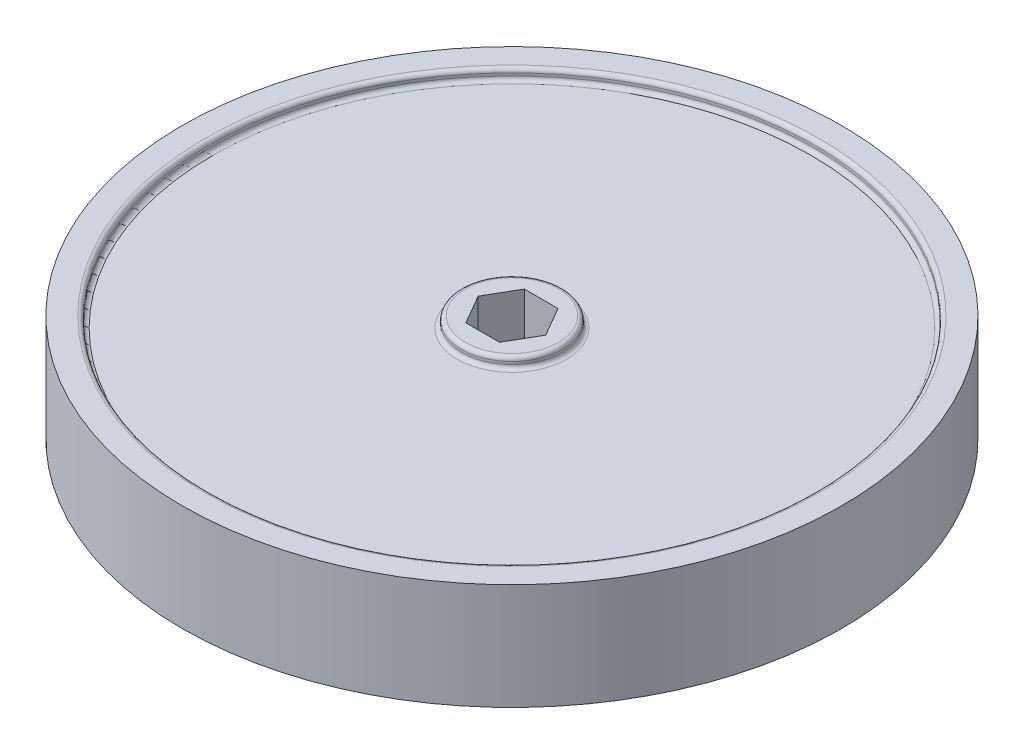
ISO-10303-21;
HEADER;
FILE_DESCRIPTION(('STEP AP214'),'2;1');
FILE_NAME('part.step','',(''),(''),'','','');
FILE_SCHEMA(('AUTOMOTIVE_DESIGN { 1 0 10303 214 1 1 1 1 }'));
ENDSEC;
DATA;
#1=APPLICATION_CONTEXT('core data for automotive mechanical design processes');
#2=APPLICATION_PROTOCOL_DEFINITION('international standard','automotive_design',2000,#1);
#3=PRODUCT_CONTEXT('',#1,'mechanical');
#4=PRODUCT('Part','Part','',(#3));
#5=PRODUCT_RELATED_PRODUCT_CATEGORY('part','',(#4));
#6=PRODUCT_DEFINITION_FORMATION('','',#4);
#7=PRODUCT_DEFINITION_CONTEXT('part definition',#1,'design');
#8=PRODUCT_DEFINITION('design','',#6,#7);
#9=PRODUCT_DEFINITION_SHAPE('','',#8);
#10=(LENGTH_UNIT() NAMED_UNIT(*) SI_UNIT(.MILLI.,.METRE.));
#11=(NAMED_UNIT(*) PLANE_ANGLE_UNIT() SI_UNIT($,.RADIAN.));
#12=(NAMED_UNIT(*) SI_UNIT($,.STERADIAN.) SOLID_ANGLE_UNIT());
#13=UNCERTAINTY_MEASURE_WITH_UNIT(LENGTH_MEASURE(1.E-05),#10,'distance_accuracy_value','');
#14=(GEOMETRIC_REPRESENTATION_CONTEXT(3) GLOBAL_UNCERTAINTY_ASSIGNED_CONTEXT((#13)) GLOBAL_UNIT_ASSIGNED_CONTEXT((#10,
#11,#12)) REPRESENTATION_CONTEXT('',''));
#15=CARTESIAN_POINT('',(0.,0.,0.));
#16=DIRECTION('',(0.,0.,1.));
#17=DIRECTION('',(1.,0.,0.));
#18=AXIS2_PLACEMENT_3D('',#15,#16,#17);
#19=CARTESIAN_POINT('',(0.,10.,0.));
#20=DIRECTION('',(0.,1.,0.));
#21=DIRECTION('',(0.,0.,1.));
#22=AXIS2_PLACEMENT_3D('',#19,#20,#21);
#23=PLANE('',#22);
#24=CARTESIAN_POINT('',(0.,10.,0.));
#25=DIRECTION('',(0.,1.,0.));
#26=DIRECTION('',(0.,0.,1.));
#27=AXIS2_PLACEMENT_3D('',#24,#25,#26);
#28=CIRCLE('',#27,57.75);
#29=CARTESIAN_POINT('',(0.,10.,57.75));
#30=VERTEX_POINT('',#29);
#31=EDGE_CURVE('E178',#30,#30,#28,.F.);
#32=ORIENTED_EDGE('',*,*,#31,.T.);
#33=EDGE_LOOP('',(#32));
#34=FACE_BOUND('',#33,.T.);
#35=CARTESIAN_POINT('',(0.,10.,0.));
#36=DIRECTION('',(0.,1.,0.));
#37=DIRECTION('',(0.,0.,1.));
#38=AXIS2_PLACEMENT_3D('',#35,#36,#37);
#39=CIRCLE('',#38,62.);
#40=CARTESIAN_POINT('',(0.,10.,62.));
#41=VERTEX_POINT('',#40);
#42=EDGE_CURVE('E158',#41,#41,#39,.T.);
#43=ORIENTED_EDGE('',*,*,#42,.T.);
#44=EDGE_LOOP('',(#43));
#45=FACE_BOUND('',#44,.T.);
#46=ADVANCED_FACE('F41',(#34,#45),#23,.T.);
#47=CARTESIAN_POINT('',(0.,-8.,0.));
#48=DIRECTION('',(0.,-1.,0.));
#49=DIRECTION('',(0.,0.,-1.));
#50=AXIS2_PLACEMENT_3D('',#47,#48,#49);
#51=PLANE('',#50);
#52=CARTESIAN_POINT('',(0.,-8.,0.));
#53=DIRECTION('',(0.,-1.,0.));
#54=DIRECTION('',(0.,0.,-1.));
#55=AXIS2_PLACEMENT_3D('',#52,#53,#54);
#56=CIRCLE('',#55,56.25);
#57=CARTESIAN_POINT('',(0.,-8.,-56.25));
#58=VERTEX_POINT('',#57);
#59=EDGE_CURVE('E166',#58,#58,#56,.T.);
#60=ORIENTED_EDGE('',*,*,#59,.T.);
#61=EDGE_LOOP('',(#60));
#62=FACE_BOUND('',#61,.T.);
#63=CARTESIAN_POINT('',(0.,-8.,0.));
#64=DIRECTION('',(0.,-1.,0.));
#65=DIRECTION('',(0.,0.,-1.));
#66=AXIS2_PLACEMENT_3D('',#63,#64,#65);
#67=CIRCLE('',#66,9.5);
#68=CARTESIAN_POINT('',(0.,-8.,-9.5));
#69=VERTEX_POINT('',#68);
#70=EDGE_CURVE('E145',#69,#69,#67,.T.);
#71=ORIENTED_EDGE('',*,*,#70,.F.);
#72=EDGE_LOOP('',(#71));
#73=FACE_BOUND('',#72,.T.);
#74=ADVANCED_FACE('F250',(#62,#73),#51,.T.);
#75=CARTESIAN_POINT('',(0.,-10.,0.));
#76=DIRECTION('',(0.,1.,0.));
#77=DIRECTION('',(0.,0.,1.));
#78=AXIS2_PLACEMENT_3D('',#75,#76,#77);
#79=CYLINDRICAL_SURFACE('',#78,62.);
#80=CARTESIAN_POINT('',(0.,-10.,0.));
#81=DIRECTION('',(0.,1.,0.));
#82=DIRECTION('',(0.,0.,1.));
#83=AXIS2_PLACEMENT_3D('',#80,#81,#82);
#84=CIRCLE('',#83,62.);
#85=CARTESIAN_POINT('',(0.,-10.,62.));
#86=VERTEX_POINT('',#85);
#87=EDGE_CURVE('E162',#86,#86,#84,.T.);
#88=ORIENTED_EDGE('',*,*,#87,.T.);
#89=EDGE_LOOP('',(#88));
#90=FACE_BOUND('',#89,.T.);
#91=ORIENTED_EDGE('',*,*,#42,.F.);
#92=EDGE_LOOP('',(#91));
#93=FACE_BOUND('',#92,.T.);
#94=ADVANCED_FACE('F256',(#90,#93),#79,.T.);
#95=CARTESIAN_POINT('',(62.,-10.,0.));
#96=DIRECTION('',(0.,-1.,0.));
#97=DIRECTION('',(0.,0.,-1.));
#98=AXIS2_PLACEMENT_3D('',#95,#96,#97);
#99=PLANE('',#98);
#100=CARTESIAN_POINT('',(0.,-10.,0.));
#101=DIRECTION('',(0.,-1.,0.));
#102=DIRECTION('',(0.,0.,-1.));
#103=AXIS2_PLACEMENT_3D('',#100,#101,#102);
#104=CIRCLE('',#103,57.75);
#105=CARTESIAN_POINT('',(0.,-10.,-57.75));
#106=VERTEX_POINT('',#105);
#107=EDGE_CURVE('E11',#106,#106,#104,.F.);
#108=ORIENTED_EDGE('',*,*,#107,.T.);
#109=EDGE_LOOP('',(#108));
#110=FACE_BOUND('',#109,.T.);
#111=ORIENTED_EDGE('',*,*,#87,.F.);
#112=EDGE_LOOP('',(#111));
#113=FACE_BOUND('',#112,.T.);
#114=ADVANCED_FACE('F263',(#110,#113),#99,.T.);
#115=CARTESIAN_POINT('',(0.,-8.,0.));
#116=DIRECTION('',(0.,-1.,0.));
#117=DIRECTION('',(0.,0.,-1.));
#118=AXIS2_PLACEMENT_3D('',#115,#116,#117);
#119=CYLINDRICAL_SURFACE('',#118,57.);
#120=CARTESIAN_POINT('',(0.,-8.75,0.));
#121=DIRECTION('',(0.,-1.,0.));
#122=DIRECTION('',(0.,0.,-1.));
#123=AXIS2_PLACEMENT_3D('',#120,#121,#122);
#124=CIRCLE('',#123,57.);
#125=CARTESIAN_POINT('',(0.,-8.75,-57.));
#126=VERTEX_POINT('',#125);
#127=EDGE_CURVE('E174',#126,#126,#124,.F.);
#128=ORIENTED_EDGE('',*,*,#127,.T.);
#129=EDGE_LOOP('',(#128));
#130=FACE_BOUND('',#129,.T.);
#131=CARTESIAN_POINT('',(0.,-9.25,0.));
#132=DIRECTION('',(0.,-1.,0.));
#133=DIRECTION('',(0.,0.,-1.));
#134=AXIS2_PLACEMENT_3D('',#131,#132,#133);
#135=CIRCLE('',#134,57.);
#136=CARTESIAN_POINT('',(0.,-9.25,-57.));
#137=VERTEX_POINT('',#136);
#138=EDGE_CURVE('E170',#137,#137,#135,.T.);
#139=ORIENTED_EDGE('',*,*,#138,.T.);
#140=EDGE_LOOP('',(#139));
#141=FACE_BOUND('',#140,.T.);
#142=ADVANCED_FACE('F262',(#130,#141),#119,.F.);
#143=CARTESIAN_POINT('',(0.,-10.,0.));
#144=DIRECTION('',(0.,1.,0.));
#145=DIRECTION('',(0.,0.,1.));
#146=AXIS2_PLACEMENT_3D('',#143,#144,#145);
#147=CYLINDRICAL_SURFACE('',#146,9.5);
#148=CARTESIAN_POINT('',(0.,-9.25,0.));
#149=DIRECTION('',(0.,-1.,0.));
#150=DIRECTION('',(0.,0.,-1.));
#151=AXIS2_PLACEMENT_3D('',#148,#149,#150);
#152=CIRCLE('',#151,9.5);
#153=CARTESIAN_POINT('',(0.,-9.25,-9.5));
#154=VERTEX_POINT('',#153);
#155=EDGE_CURVE('E50',#154,#154,#152,.F.);
#156=ORIENTED_EDGE('',*,*,#155,.T.);
#157=EDGE_LOOP('',(#156));
#158=FACE_BOUND('',#157,.T.);
#159=ORIENTED_EDGE('',*,*,#70,.T.);
#160=EDGE_LOOP('',(#159));
#161=FACE_BOUND('',#160,.T.);
#162=ADVANCED_FACE('F215',(#158,#161),#147,.T.);
#163=CARTESIAN_POINT('',(0.,-10.,0.));
#164=DIRECTION('',(0.,-1.,0.));
#165=DIRECTION('',(0.,0.,-1.));
#166=AXIS2_PLACEMENT_3D('',#163,#164,#165);
#167=PLANE('',#166);
#168=CARTESIAN_POINT('',(0.,-10.,0.));
#169=DIRECTION('',(0.,-1.,0.));
#170=DIRECTION('',(0.,0.,-1.));
#171=AXIS2_PLACEMENT_3D('',#168,#169,#170);
#172=CIRCLE('',#171,8.75);
#173=CARTESIAN_POINT('',(0.,-10.,-8.75));
#174=VERTEX_POINT('',#173);
#175=EDGE_CURVE('E210',#174,#174,#172,.T.);
#176=ORIENTED_EDGE('',*,*,#175,.T.);
#177=EDGE_LOOP('',(#176));
#178=FACE_BOUND('',#177,.T.);
#179=DIRECTION('',(-0.5,0.,-0.866025403784439));
#180=VECTOR('',#179,1.);
#181=CARTESIAN_POINT('',(6.35,-10.,0.));
#182=LINE('',#181,#180);
#183=CARTESIAN_POINT('',(6.35,-10.,0.));
#184=VERTEX_POINT('',#183);
#185=CARTESIAN_POINT('',(3.175,-10.,-5.49926131403118));
#186=VERTEX_POINT('',#185);
#187=EDGE_CURVE('E128',#184,#186,#182,.T.);
#188=ORIENTED_EDGE('',*,*,#187,.T.);
#189=DIRECTION('',(-1.,0.,0.));
#190=VECTOR('',#189,1.);
#191=CARTESIAN_POINT('',(3.175,-10.,-5.49926131403118));
#192=LINE('',#191,#190);
#193=CARTESIAN_POINT('',(-3.175,-10.,-5.49926131403118));
#194=VERTEX_POINT('',#193);
#195=EDGE_CURVE('E131',#186,#194,#192,.T.);
#196=ORIENTED_EDGE('',*,*,#195,.T.);
#197=DIRECTION('',(-0.5,0.,0.866025403784439));
#198=VECTOR('',#197,1.);
#199=CARTESIAN_POINT('',(-3.175,-10.,-5.49926131403118));
#200=LINE('',#199,#198);
#201=CARTESIAN_POINT('',(-6.35,-10.,0.));
#202=VERTEX_POINT('',#201);
#203=EDGE_CURVE('E57',#194,#202,#200,.T.);
#204=ORIENTED_EDGE('',*,*,#203,.T.);
#205=DIRECTION('',(0.5,0.,0.866025403784439));
#206=VECTOR('',#205,1.);
#207=CARTESIAN_POINT('',(-6.35,-10.,0.));
#208=LINE('',#207,#206);
#209=CARTESIAN_POINT('',(-3.175,-10.,5.49926131403119));
#210=VERTEX_POINT('',#209);
#211=EDGE_CURVE('E134',#202,#210,#208,.T.);
#212=ORIENTED_EDGE('',*,*,#211,.T.);
#213=DIRECTION('',(1.,0.,0.));
#214=VECTOR('',#213,1.);
#215=CARTESIAN_POINT('',(-3.175,-10.,5.49926131403119));
#216=LINE('',#215,#214);
#217=CARTESIAN_POINT('',(3.175,-10.,5.49926131403119));
#218=VERTEX_POINT('',#217);
#219=EDGE_CURVE('E137',#210,#218,#216,.T.);
#220=ORIENTED_EDGE('',*,*,#219,.T.);
#221=DIRECTION('',(0.5,0.,-0.866025403784439));
#222=VECTOR('',#221,1.);
#223=CARTESIAN_POINT('',(3.175,-10.,5.49926131403119));
#224=LINE('',#223,#222);
#225=EDGE_CURVE('E140',#218,#184,#224,.T.);
#226=ORIENTED_EDGE('',*,*,#225,.T.);
#227=EDGE_LOOP('',(#188,#196,#204,#212,#220,#226));
#228=FACE_BOUND('',#227,.T.);
#229=ADVANCED_FACE('F224',(#178,#228),#167,.T.);
#230=CARTESIAN_POINT('',(0.,8.,0.));
#231=DIRECTION('',(0.,1.,0.));
#232=DIRECTION('',(0.,0.,1.));
#233=AXIS2_PLACEMENT_3D('',#230,#231,#232);
#234=CYLINDRICAL_SURFACE('',#233,57.);
#235=CARTESIAN_POINT('',(0.,9.25,0.));
#236=DIRECTION('',(0.,1.,0.));
#237=DIRECTION('',(0.,0.,1.));
#238=AXIS2_PLACEMENT_3D('',#235,#236,#237);
#239=CIRCLE('',#238,57.);
#240=CARTESIAN_POINT('',(0.,9.25,57.));
#241=VERTEX_POINT('',#240);
#242=EDGE_CURVE('E186',#241,#241,#239,.T.);
#243=ORIENTED_EDGE('',*,*,#242,.T.);
#244=EDGE_LOOP('',(#243));
#245=FACE_BOUND('',#244,.T.);
#246=CARTESIAN_POINT('',(0.,8.75,0.));
#247=DIRECTION('',(0.,1.,0.));
#248=DIRECTION('',(0.,0.,1.));
#249=AXIS2_PLACEMENT_3D('',#246,#247,#248);
#250=CIRCLE('',#249,57.);
#251=CARTESIAN_POINT('',(0.,8.75,57.));
#252=VERTEX_POINT('',#251);
#253=EDGE_CURVE('E182',#252,#252,#250,.F.);
#254=ORIENTED_EDGE('',*,*,#253,.T.);
#255=EDGE_LOOP('',(#254));
#256=FACE_BOUND('',#255,.T.);
#257=ADVANCED_FACE('F227',(#245,#256),#234,.F.);
#258=CARTESIAN_POINT('',(0.,8.,0.));
#259=DIRECTION('',(0.,1.,0.));
#260=DIRECTION('',(0.,0.,-1.));
#261=AXIS2_PLACEMENT_3D('',#258,#259,#260);
#262=PLANE('',#261);
#263=CARTESIAN_POINT('',(0.,8.,0.));
#264=DIRECTION('',(0.,1.,0.));
#265=DIRECTION('',(0.,0.,1.));
#266=AXIS2_PLACEMENT_3D('',#263,#264,#265);
#267=CIRCLE('',#266,56.25);
#268=CARTESIAN_POINT('',(0.,8.,56.25));
#269=VERTEX_POINT('',#268);
#270=EDGE_CURVE('E194',#269,#269,#267,.T.);
#271=ORIENTED_EDGE('',*,*,#270,.T.);
#272=EDGE_LOOP('',(#271));
#273=FACE_BOUND('',#272,.T.);
#274=CARTESIAN_POINT('',(0.,8.,0.));
#275=DIRECTION('',(0.,1.,0.));
#276=DIRECTION('',(0.,0.,1.));
#277=AXIS2_PLACEMENT_3D('',#274,#275,#276);
#278=CIRCLE('',#277,10.25);
#279=CARTESIAN_POINT('',(0.,8.,10.25));
#280=VERTEX_POINT('',#279);
#281=EDGE_CURVE('E190',#280,#280,#278,.F.);
#282=ORIENTED_EDGE('',*,*,#281,.T.);
#283=EDGE_LOOP('',(#282));
#284=FACE_BOUND('',#283,.T.);
#285=ADVANCED_FACE('F296',(#273,#284),#262,.T.);
#286=CARTESIAN_POINT('',(0.,10.,0.));
#287=DIRECTION('',(0.,-1.,0.));
#288=DIRECTION('',(0.,0.,-1.));
#289=AXIS2_PLACEMENT_3D('',#286,#287,#288);
#290=CYLINDRICAL_SURFACE('',#289,9.5);
#291=CARTESIAN_POINT('',(0.,8.75,0.));
#292=DIRECTION('',(0.,1.,0.));
#293=DIRECTION('',(0.,0.,1.));
#294=AXIS2_PLACEMENT_3D('',#291,#292,#293);
#295=CIRCLE('',#294,9.5);
#296=CARTESIAN_POINT('',(0.,8.75,9.5));
#297=VERTEX_POINT('',#296);
#298=EDGE_CURVE('E202',#297,#297,#295,.T.);
#299=ORIENTED_EDGE('',*,*,#298,.T.);
#300=EDGE_LOOP('',(#299));
#301=FACE_BOUND('',#300,.T.);
#302=CARTESIAN_POINT('',(0.,9.25,0.));
#303=DIRECTION('',(0.,1.,0.));
#304=DIRECTION('',(0.,0.,1.));
#305=AXIS2_PLACEMENT_3D('',#302,#303,#304);
#306=CIRCLE('',#305,9.5);
#307=CARTESIAN_POINT('',(0.,9.25,9.5));
#308=VERTEX_POINT('',#307);
#309=EDGE_CURVE('E198',#308,#308,#306,.F.);
#310=ORIENTED_EDGE('',*,*,#309,.T.);
#311=EDGE_LOOP('',(#310));
#312=FACE_BOUND('',#311,.T.);
#313=ADVANCED_FACE('F294',(#301,#312),#290,.T.);
#314=CARTESIAN_POINT('',(0.,10.,0.));
#315=DIRECTION('',(0.,1.,0.));
#316=DIRECTION('',(0.,0.,-1.));
#317=AXIS2_PLACEMENT_3D('',#314,#315,#316);
#318=PLANE('',#317);
#319=CARTESIAN_POINT('',(0.,10.,0.));
#320=DIRECTION('',(0.,1.,0.));
#321=DIRECTION('',(0.,0.,1.));
#322=AXIS2_PLACEMENT_3D('',#319,#320,#321);
#323=CIRCLE('',#322,8.75);
#324=CARTESIAN_POINT('',(0.,10.,8.75));
#325=VERTEX_POINT('',#324);
#326=EDGE_CURVE('E206',#325,#325,#323,.T.);
#327=ORIENTED_EDGE('',*,*,#326,.T.);
#328=EDGE_LOOP('',(#327));
#329=FACE_BOUND('',#328,.T.);
#330=DIRECTION('',(-0.5,0.,-0.866025403784439));
#331=VECTOR('',#330,1.);
#332=CARTESIAN_POINT('',(6.35,10.,0.));
#333=LINE('',#332,#331);
#334=CARTESIAN_POINT('',(6.35,10.,0.));
#335=VERTEX_POINT('',#334);
#336=CARTESIAN_POINT('',(3.175,10.,-5.49926131403118));
#337=VERTEX_POINT('',#336);
#338=EDGE_CURVE('E65',#335,#337,#333,.T.);
#339=ORIENTED_EDGE('',*,*,#338,.F.);
#340=DIRECTION('',(0.5,0.,-0.866025403784439));
#341=VECTOR('',#340,1.);
#342=CARTESIAN_POINT('',(3.175,10.,5.49926131403119));
#343=LINE('',#342,#341);
#344=CARTESIAN_POINT('',(3.175,10.,5.49926131403119));
#345=VERTEX_POINT('',#344);
#346=EDGE_CURVE('E125',#345,#335,#343,.T.);
#347=ORIENTED_EDGE('',*,*,#346,.F.);
#348=DIRECTION('',(1.,0.,0.));
#349=VECTOR('',#348,1.);
#350=CARTESIAN_POINT('',(-3.175,10.,5.49926131403119));
#351=LINE('',#350,#349);
#352=CARTESIAN_POINT('',(-3.175,10.,5.49926131403119));
#353=VERTEX_POINT('',#352);
#354=EDGE_CURVE('E118',#353,#345,#351,.T.);
#355=ORIENTED_EDGE('',*,*,#354,.F.);
#356=DIRECTION('',(0.5,0.,0.866025403784439));
#357=VECTOR('',#356,1.);
#358=CARTESIAN_POINT('',(-6.35,10.,0.));
#359=LINE('',#358,#357);
#360=CARTESIAN_POINT('',(-6.35,10.,0.));
#361=VERTEX_POINT('',#360);
#362=EDGE_CURVE('E115',#361,#353,#359,.T.);
#363=ORIENTED_EDGE('',*,*,#362,.F.);
#364=DIRECTION('',(-0.5,0.,0.866025403784439));
#365=VECTOR('',#364,1.);
#366=CARTESIAN_POINT('',(-3.175,10.,-5.49926131403118));
#367=LINE('',#366,#365);
#368=CARTESIAN_POINT('',(-3.175,10.,-5.49926131403118));
#369=VERTEX_POINT('',#368);
#370=EDGE_CURVE('E98',#369,#361,#367,.T.);
#371=ORIENTED_EDGE('',*,*,#370,.F.);
#372=DIRECTION('',(-1.,0.,0.));
#373=VECTOR('',#372,1.);
#374=CARTESIAN_POINT('',(3.175,10.,-5.49926131403118));
#375=LINE('',#374,#373);
#376=EDGE_CURVE('E108',#337,#369,#375,.T.);
#377=ORIENTED_EDGE('',*,*,#376,.F.);
#378=EDGE_LOOP('',(#339,#347,#355,#363,#371,#377));
#379=FACE_BOUND('',#378,.T.);
#380=ADVANCED_FACE('F112',(#329,#379),#318,.T.);
#381=CARTESIAN_POINT('',(6.35,-10.,0.));
#382=DIRECTION('',(0.866025403784439,0.,-0.5));
#383=DIRECTION('',(-0.5,0.,-0.866025403784439));
#384=AXIS2_PLACEMENT_3D('',#381,#382,#383);
#385=PLANE('',#384);
#386=DIRECTION('',(0.,1.,0.));
#387=VECTOR('',#386,1.);
#388=CARTESIAN_POINT('',(3.175,-10.,-5.49926131403118));
#389=LINE('',#388,#387);
#390=EDGE_CURVE('E105',#186,#337,#389,.T.);
#391=ORIENTED_EDGE('',*,*,#390,.F.);
#392=ORIENTED_EDGE('',*,*,#187,.F.);
#393=DIRECTION('',(0.,1.,0.));
#394=VECTOR('',#393,1.);
#395=CARTESIAN_POINT('',(6.35,-10.,0.));
#396=LINE('',#395,#394);
#397=EDGE_CURVE('E143',#184,#335,#396,.T.);
#398=ORIENTED_EDGE('',*,*,#397,.T.);
#399=ORIENTED_EDGE('',*,*,#338,.T.);
#400=EDGE_LOOP('',(#391,#392,#398,#399));
#401=FACE_BOUND('',#400,.T.);
#402=ADVANCED_FACE('F231',(#401),#385,.F.);
#403=CARTESIAN_POINT('',(3.175,-10.,5.49926131403119));
#404=DIRECTION('',(0.866025403784439,0.,0.5));
#405=DIRECTION('',(0.5,0.,-0.866025403784439));
#406=AXIS2_PLACEMENT_3D('',#403,#404,#405);
#407=PLANE('',#406);
#408=ORIENTED_EDGE('',*,*,#397,.F.);
#409=ORIENTED_EDGE('',*,*,#225,.F.);
#410=DIRECTION('',(0.,1.,0.));
#411=VECTOR('',#410,1.);
#412=CARTESIAN_POINT('',(3.175,-10.,5.49926131403119));
#413=LINE('',#412,#411);
#414=EDGE_CURVE('E146',#218,#345,#413,.T.);
#415=ORIENTED_EDGE('',*,*,#414,.T.);
#416=ORIENTED_EDGE('',*,*,#346,.T.);
#417=EDGE_LOOP('',(#408,#409,#415,#416));
#418=FACE_BOUND('',#417,.T.);
#419=ADVANCED_FACE('F234',(#418),#407,.F.);
#420=CARTESIAN_POINT('',(-3.175,-10.,5.49926131403119));
#421=DIRECTION('',(0.,0.,1.));
#422=DIRECTION('',(1.,0.,0.));
#423=AXIS2_PLACEMENT_3D('',#420,#421,#422);
#424=PLANE('',#423);
#425=ORIENTED_EDGE('',*,*,#414,.F.);
#426=ORIENTED_EDGE('',*,*,#219,.F.);
#427=DIRECTION('',(0.,1.,0.));
#428=VECTOR('',#427,1.);
#429=CARTESIAN_POINT('',(-3.175,-10.,5.49926131403119));
#430=LINE('',#429,#428);
#431=EDGE_CURVE('E149',#210,#353,#430,.T.);
#432=ORIENTED_EDGE('',*,*,#431,.T.);
#433=ORIENTED_EDGE('',*,*,#354,.T.);
#434=EDGE_LOOP('',(#425,#426,#432,#433));
#435=FACE_BOUND('',#434,.T.);
#436=ADVANCED_FACE('F236',(#435),#424,.F.);
#437=CARTESIAN_POINT('',(-6.35,-10.,0.));
#438=DIRECTION('',(-0.866025403784439,0.,0.5));
#439=DIRECTION('',(0.5,0.,0.866025403784439));
#440=AXIS2_PLACEMENT_3D('',#437,#438,#439);
#441=PLANE('',#440);
#442=ORIENTED_EDGE('',*,*,#431,.F.);
#443=ORIENTED_EDGE('',*,*,#211,.F.);
#444=DIRECTION('',(0.,1.,0.));
#445=VECTOR('',#444,1.);
#446=CARTESIAN_POINT('',(-6.35,-10.,0.));
#447=LINE('',#446,#445);
#448=EDGE_CURVE('E104',#202,#361,#447,.T.);
#449=ORIENTED_EDGE('',*,*,#448,.T.);
#450=ORIENTED_EDGE('',*,*,#362,.T.);
#451=EDGE_LOOP('',(#442,#443,#449,#450));
#452=FACE_BOUND('',#451,.T.);
#453=ADVANCED_FACE('F240',(#452),#441,.F.);
#454=CARTESIAN_POINT('',(-3.175,-10.,-5.49926131403118));
#455=DIRECTION('',(-0.866025403784439,0.,-0.5));
#456=DIRECTION('',(-0.5,0.,0.866025403784439));
#457=AXIS2_PLACEMENT_3D('',#454,#455,#456);
#458=PLANE('',#457);
#459=ORIENTED_EDGE('',*,*,#448,.F.);
#460=ORIENTED_EDGE('',*,*,#203,.F.);
#461=DIRECTION('',(0.,1.,0.));
#462=VECTOR('',#461,1.);
#463=CARTESIAN_POINT('',(-3.175,-10.,-5.49926131403118));
#464=LINE('',#463,#462);
#465=EDGE_CURVE('E94',#194,#369,#464,.T.);
#466=ORIENTED_EDGE('',*,*,#465,.T.);
#467=ORIENTED_EDGE('',*,*,#370,.T.);
#468=EDGE_LOOP('',(#459,#460,#466,#467));
#469=FACE_BOUND('',#468,.T.);
#470=ADVANCED_FACE('F96',(#469),#458,.F.);
#471=CARTESIAN_POINT('',(3.175,-10.,-5.49926131403118));
#472=DIRECTION('',(0.,0.,-1.));
#473=DIRECTION('',(-1.,0.,0.));
#474=AXIS2_PLACEMENT_3D('',#471,#472,#473);
#475=PLANE('',#474);
#476=ORIENTED_EDGE('',*,*,#465,.F.);
#477=ORIENTED_EDGE('',*,*,#195,.F.);
#478=ORIENTED_EDGE('',*,*,#390,.T.);
#479=ORIENTED_EDGE('',*,*,#376,.T.);
#480=EDGE_LOOP('',(#476,#477,#478,#479));
#481=FACE_BOUND('',#480,.T.);
#482=ADVANCED_FACE('F109',(#481),#475,.F.);
#483=CARTESIAN_POINT('',(0.,-8.75,0.));
#484=DIRECTION('',(0.,-1.,0.));
#485=DIRECTION('',(0.,0.,-1.));
#486=AXIS2_PLACEMENT_3D('',#483,#484,#485);
#487=TOROIDAL_SURFACE('',#486,56.25,0.75);
#488=ORIENTED_EDGE('',*,*,#127,.F.);
#489=EDGE_LOOP('',(#488));
#490=FACE_BOUND('',#489,.T.);
#491=ORIENTED_EDGE('',*,*,#59,.F.);
#492=EDGE_LOOP('',(#491));
#493=FACE_BOUND('',#492,.T.);
#494=ADVANCED_FACE('F270',(#490,#493),#487,.F.);
#495=CARTESIAN_POINT('',(0.,9.25,0.));
#496=DIRECTION('',(0.,1.,0.));
#497=DIRECTION('',(0.,0.,1.));
#498=AXIS2_PLACEMENT_3D('',#495,#496,#497);
#499=TOROIDAL_SURFACE('',#498,57.75,0.75);
#500=ORIENTED_EDGE('',*,*,#242,.F.);
#501=EDGE_LOOP('',(#500));
#502=FACE_BOUND('',#501,.T.);
#503=ORIENTED_EDGE('',*,*,#31,.F.);
#504=EDGE_LOOP('',(#503));
#505=FACE_BOUND('',#504,.T.);
#506=ADVANCED_FACE('F273',(#502,#505),#499,.T.);
#507=CARTESIAN_POINT('',(0.,8.75,0.));
#508=DIRECTION('',(0.,1.,0.));
#509=DIRECTION('',(0.,0.,1.));
#510=AXIS2_PLACEMENT_3D('',#507,#508,#509);
#511=TOROIDAL_SURFACE('',#510,56.25,0.75);
#512=ORIENTED_EDGE('',*,*,#270,.F.);
#513=EDGE_LOOP('',(#512));
#514=FACE_BOUND('',#513,.T.);
#515=ORIENTED_EDGE('',*,*,#253,.F.);
#516=EDGE_LOOP('',(#515));
#517=FACE_BOUND('',#516,.T.);
#518=ADVANCED_FACE('F277',(#514,#517),#511,.F.);
#519=CARTESIAN_POINT('',(0.,8.75,0.));
#520=DIRECTION('',(0.,1.,0.));
#521=DIRECTION('',(0.,0.,1.));
#522=AXIS2_PLACEMENT_3D('',#519,#520,#521);
#523=TOROIDAL_SURFACE('',#522,10.25,0.75);
#524=ORIENTED_EDGE('',*,*,#281,.F.);
#525=EDGE_LOOP('',(#524));
#526=FACE_BOUND('',#525,.T.);
#527=ORIENTED_EDGE('',*,*,#298,.F.);
#528=EDGE_LOOP('',(#527));
#529=FACE_BOUND('',#528,.T.);
#530=ADVANCED_FACE('F281',(#526,#529),#523,.F.);
#531=CARTESIAN_POINT('',(0.,9.25,0.));
#532=DIRECTION('',(0.,1.,0.));
#533=DIRECTION('',(0.,0.,1.));
#534=AXIS2_PLACEMENT_3D('',#531,#532,#533);
#535=TOROIDAL_SURFACE('',#534,8.75,0.75);
#536=ORIENTED_EDGE('',*,*,#326,.F.);
#537=EDGE_LOOP('',(#536));
#538=FACE_BOUND('',#537,.T.);
#539=ORIENTED_EDGE('',*,*,#309,.F.);
#540=EDGE_LOOP('',(#539));
#541=FACE_BOUND('',#540,.T.);
#542=ADVANCED_FACE('F221',(#538,#541),#535,.T.);
#543=CARTESIAN_POINT('',(0.,-9.25,0.));
#544=DIRECTION('',(0.,-1.,0.));
#545=DIRECTION('',(0.,0.,-1.));
#546=AXIS2_PLACEMENT_3D('',#543,#544,#545);
#547=TOROIDAL_SURFACE('',#546,8.75,0.75);
#548=ORIENTED_EDGE('',*,*,#155,.F.);
#549=EDGE_LOOP('',(#548));
#550=FACE_BOUND('',#549,.T.);
#551=ORIENTED_EDGE('',*,*,#175,.F.);
#552=EDGE_LOOP('',(#551));
#553=FACE_BOUND('',#552,.T.);
#554=ADVANCED_FACE('F218',(#550,#553),#547,.T.);
#555=CARTESIAN_POINT('',(0.,-9.25,0.));
#556=DIRECTION('',(0.,-1.,0.));
#557=DIRECTION('',(0.,0.,-1.));
#558=AXIS2_PLACEMENT_3D('',#555,#556,#557);
#559=TOROIDAL_SURFACE('',#558,57.75,0.75);
#560=ORIENTED_EDGE('',*,*,#107,.F.);
#561=EDGE_LOOP('',(#560));
#562=FACE_BOUND('',#561,.T.);
#563=ORIENTED_EDGE('',*,*,#138,.F.);
#564=EDGE_LOOP('',(#563));
#565=FACE_BOUND('',#564,.T.);
#566=ADVANCED_FACE('F43',(#562,#565),#559,.T.);
#567=CLOSED_SHELL('',(#46,#74,#94,#114,#142,#162,#229,#257,#285,#313,#380,#402,#419,#436,#453,
#470,#482,#494,#506,#518,#530,#542,#554,#566));
#568=MANIFOLD_SOLID_BREP('B2',#567);
#569=ADVANCED_BREP_SHAPE_REPRESENTATION('',(#18,#568),#14);
#570=SHAPE_DEFINITION_REPRESENTATION(#9,#569);
ENDSEC;
END-ISO-10303-21;
